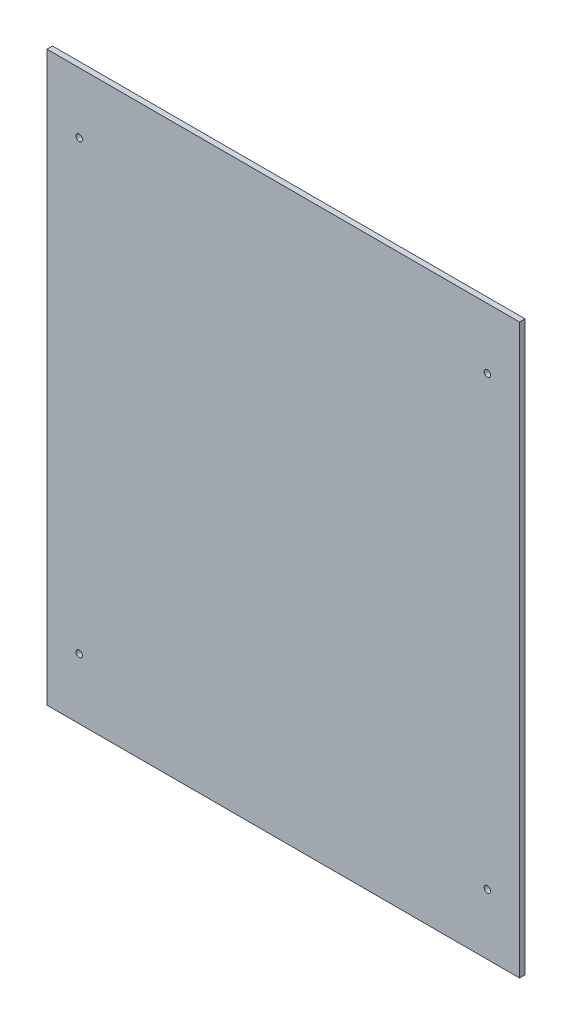
ISO-10303-21;
HEADER;
FILE_DESCRIPTION(('STEP AP214'),'2;1');
FILE_NAME('part.step','',(''),(''),'','','');
FILE_SCHEMA(('AUTOMOTIVE_DESIGN { 1 0 10303 214 1 1 1 1 }'));
ENDSEC;
DATA;
#1=APPLICATION_CONTEXT('core data for automotive mechanical design processes');
#2=APPLICATION_PROTOCOL_DEFINITION('international standard','automotive_design',2000,#1);
#3=PRODUCT_CONTEXT('',#1,'mechanical');
#4=PRODUCT('Part','Part','',(#3));
#5=PRODUCT_RELATED_PRODUCT_CATEGORY('part','',(#4));
#6=PRODUCT_DEFINITION_FORMATION('','',#4);
#7=PRODUCT_DEFINITION_CONTEXT('part definition',#1,'design');
#8=PRODUCT_DEFINITION('design','',#6,#7);
#9=PRODUCT_DEFINITION_SHAPE('','',#8);
#10=(LENGTH_UNIT() NAMED_UNIT(*) SI_UNIT(.MILLI.,.METRE.));
#11=(NAMED_UNIT(*) PLANE_ANGLE_UNIT() SI_UNIT($,.RADIAN.));
#12=(NAMED_UNIT(*) SI_UNIT($,.STERADIAN.) SOLID_ANGLE_UNIT());
#13=UNCERTAINTY_MEASURE_WITH_UNIT(LENGTH_MEASURE(1.E-05),#10,'distance_accuracy_value','');
#14=(GEOMETRIC_REPRESENTATION_CONTEXT(3) GLOBAL_UNCERTAINTY_ASSIGNED_CONTEXT((#13)) GLOBAL_UNIT_ASSIGNED_CONTEXT((#10,
#11,#12)) REPRESENTATION_CONTEXT('',''));
#15=CARTESIAN_POINT('',(0.,0.,0.));
#16=DIRECTION('',(0.,0.,1.));
#17=DIRECTION('',(1.,0.,0.));
#18=AXIS2_PLACEMENT_3D('',#15,#16,#17);
#19=CARTESIAN_POINT('',(0.,0.,3.));
#20=DIRECTION('',(0.,0.,-1.));
#21=DIRECTION('',(-1.,0.,0.));
#22=AXIS2_PLACEMENT_3D('',#19,#20,#21);
#23=PLANE('',#22);
#24=DIRECTION('',(0.,-1.,0.));
#25=VECTOR('',#24,1.);
#26=CARTESIAN_POINT('',(-128.5,154.5,3.));
#27=LINE('',#26,#25);
#28=CARTESIAN_POINT('',(-128.5,154.5,3.));
#29=VERTEX_POINT('',#28);
#30=CARTESIAN_POINT('',(-128.5,-154.5,3.));
#31=VERTEX_POINT('',#30);
#32=EDGE_CURVE('E91',#29,#31,#27,.T.);
#33=ORIENTED_EDGE('',*,*,#32,.T.);
#34=DIRECTION('',(1.,0.,0.));
#35=VECTOR('',#34,1.);
#36=CARTESIAN_POINT('',(128.5,-154.5,3.));
#37=LINE('',#36,#35);
#38=CARTESIAN_POINT('',(128.5,-154.5,3.));
#39=VERTEX_POINT('',#38);
#40=EDGE_CURVE('E86',#31,#39,#37,.T.);
#41=ORIENTED_EDGE('',*,*,#40,.T.);
#42=DIRECTION('',(0.,1.,0.));
#43=VECTOR('',#42,1.);
#44=CARTESIAN_POINT('',(128.5,154.5,3.));
#45=LINE('',#44,#43);
#46=CARTESIAN_POINT('',(128.5,154.5,3.));
#47=VERTEX_POINT('',#46);
#48=EDGE_CURVE('E89',#39,#47,#45,.T.);
#49=ORIENTED_EDGE('',*,*,#48,.T.);
#50=DIRECTION('',(-1.,0.,0.));
#51=VECTOR('',#50,1.);
#52=CARTESIAN_POINT('',(128.5,154.5,3.));
#53=LINE('',#52,#51);
#54=EDGE_CURVE('E56',#47,#29,#53,.T.);
#55=ORIENTED_EDGE('',*,*,#54,.T.);
#56=EDGE_LOOP('',(#33,#41,#49,#55));
#57=FACE_BOUND('',#56,.T.);
#58=CARTESIAN_POINT('',(-111.,121.5,3.));
#59=DIRECTION('',(0.,0.,1.));
#60=DIRECTION('',(1.,0.,0.));
#61=AXIS2_PLACEMENT_3D('',#58,#59,#60);
#62=CIRCLE('',#61,1.75);
#63=CARTESIAN_POINT('',(-109.25,121.5,3.));
#64=VERTEX_POINT('',#63);
#65=EDGE_CURVE('E106',#64,#64,#62,.T.);
#66=ORIENTED_EDGE('',*,*,#65,.F.);
#67=EDGE_LOOP('',(#66));
#68=FACE_BOUND('',#67,.T.);
#69=CARTESIAN_POINT('',(111.,121.5,3.));
#70=DIRECTION('',(0.,0.,1.));
#71=DIRECTION('',(-1.,0.,0.));
#72=AXIS2_PLACEMENT_3D('',#69,#70,#71);
#73=CIRCLE('',#72,1.75);
#74=CARTESIAN_POINT('',(109.25,121.5,3.));
#75=VERTEX_POINT('',#74);
#76=EDGE_CURVE('E121',#75,#75,#73,.T.);
#77=ORIENTED_EDGE('',*,*,#76,.F.);
#78=EDGE_LOOP('',(#77));
#79=FACE_BOUND('',#78,.T.);
#80=CARTESIAN_POINT('',(111.,-121.5,3.));
#81=DIRECTION('',(0.,0.,1.));
#82=DIRECTION('',(1.,0.,0.));
#83=AXIS2_PLACEMENT_3D('',#80,#81,#82);
#84=CIRCLE('',#83,1.75);
#85=CARTESIAN_POINT('',(112.75,-121.5,3.));
#86=VERTEX_POINT('',#85);
#87=EDGE_CURVE('E127',#86,#86,#84,.T.);
#88=ORIENTED_EDGE('',*,*,#87,.F.);
#89=EDGE_LOOP('',(#88));
#90=FACE_BOUND('',#89,.T.);
#91=CARTESIAN_POINT('',(-111.,-121.5,3.));
#92=DIRECTION('',(0.,0.,1.));
#93=DIRECTION('',(-1.,0.,0.));
#94=AXIS2_PLACEMENT_3D('',#91,#92,#93);
#95=CIRCLE('',#94,1.75);
#96=CARTESIAN_POINT('',(-112.75,-121.5,3.));
#97=VERTEX_POINT('',#96);
#98=EDGE_CURVE('E133',#97,#97,#95,.T.);
#99=ORIENTED_EDGE('',*,*,#98,.F.);
#100=EDGE_LOOP('',(#99));
#101=FACE_BOUND('',#100,.T.);
#102=ADVANCED_FACE('F39',(#57,#68,#79,#90,#101),#23,.F.);
#103=CARTESIAN_POINT('',(0.,0.,0.));
#104=DIRECTION('',(0.,0.,-1.));
#105=DIRECTION('',(-1.,0.,0.));
#106=AXIS2_PLACEMENT_3D('',#103,#104,#105);
#107=PLANE('',#106);
#108=CARTESIAN_POINT('',(111.,-121.5,0.));
#109=DIRECTION('',(0.,0.,1.));
#110=DIRECTION('',(1.,0.,0.));
#111=AXIS2_PLACEMENT_3D('',#108,#109,#110);
#112=CIRCLE('',#111,1.75);
#113=CARTESIAN_POINT('',(112.75,-121.5,0.));
#114=VERTEX_POINT('',#113);
#115=EDGE_CURVE('E130',#114,#114,#112,.T.);
#116=ORIENTED_EDGE('',*,*,#115,.T.);
#117=EDGE_LOOP('',(#116));
#118=FACE_BOUND('',#117,.T.);
#119=CARTESIAN_POINT('',(-111.,121.5,0.));
#120=DIRECTION('',(0.,0.,1.));
#121=DIRECTION('',(1.,0.,0.));
#122=AXIS2_PLACEMENT_3D('',#119,#120,#121);
#123=CIRCLE('',#122,1.75);
#124=CARTESIAN_POINT('',(-109.25,121.5,0.));
#125=VERTEX_POINT('',#124);
#126=EDGE_CURVE('E118',#125,#125,#123,.T.);
#127=ORIENTED_EDGE('',*,*,#126,.T.);
#128=EDGE_LOOP('',(#127));
#129=FACE_BOUND('',#128,.T.);
#130=DIRECTION('',(0.,-1.,0.));
#131=VECTOR('',#130,1.);
#132=CARTESIAN_POINT('',(-128.5,154.5,0.));
#133=LINE('',#132,#131);
#134=CARTESIAN_POINT('',(-128.5,154.5,0.));
#135=VERTEX_POINT('',#134);
#136=CARTESIAN_POINT('',(-128.5,-154.5,0.));
#137=VERTEX_POINT('',#136);
#138=EDGE_CURVE('E103',#135,#137,#133,.T.);
#139=ORIENTED_EDGE('',*,*,#138,.F.);
#140=DIRECTION('',(-1.,0.,0.));
#141=VECTOR('',#140,1.);
#142=CARTESIAN_POINT('',(128.5,154.5,0.));
#143=LINE('',#142,#141);
#144=CARTESIAN_POINT('',(128.5,154.5,0.));
#145=VERTEX_POINT('',#144);
#146=EDGE_CURVE('E79',#145,#135,#143,.T.);
#147=ORIENTED_EDGE('',*,*,#146,.F.);
#148=DIRECTION('',(0.,1.,0.));
#149=VECTOR('',#148,1.);
#150=CARTESIAN_POINT('',(128.5,154.5,0.));
#151=LINE('',#150,#149);
#152=CARTESIAN_POINT('',(128.5,-154.5,0.));
#153=VERTEX_POINT('',#152);
#154=EDGE_CURVE('E73',#153,#145,#151,.T.);
#155=ORIENTED_EDGE('',*,*,#154,.F.);
#156=DIRECTION('',(1.,0.,0.));
#157=VECTOR('',#156,1.);
#158=CARTESIAN_POINT('',(128.5,-154.5,0.));
#159=LINE('',#158,#157);
#160=EDGE_CURVE('E95',#137,#153,#159,.T.);
#161=ORIENTED_EDGE('',*,*,#160,.F.);
#162=EDGE_LOOP('',(#139,#147,#155,#161));
#163=FACE_BOUND('',#162,.T.);
#164=CARTESIAN_POINT('',(111.,121.5,0.));
#165=DIRECTION('',(0.,0.,1.));
#166=DIRECTION('',(-1.,0.,0.));
#167=AXIS2_PLACEMENT_3D('',#164,#165,#166);
#168=CIRCLE('',#167,1.75);
#169=CARTESIAN_POINT('',(109.25,121.5,0.));
#170=VERTEX_POINT('',#169);
#171=EDGE_CURVE('E124',#170,#170,#168,.T.);
#172=ORIENTED_EDGE('',*,*,#171,.T.);
#173=EDGE_LOOP('',(#172));
#174=FACE_BOUND('',#173,.T.);
#175=CARTESIAN_POINT('',(-111.,-121.5,0.));
#176=DIRECTION('',(0.,0.,1.));
#177=DIRECTION('',(-1.,0.,0.));
#178=AXIS2_PLACEMENT_3D('',#175,#176,#177);
#179=CIRCLE('',#178,1.75);
#180=CARTESIAN_POINT('',(-112.75,-121.5,0.));
#181=VERTEX_POINT('',#180);
#182=EDGE_CURVE('E136',#181,#181,#179,.T.);
#183=ORIENTED_EDGE('',*,*,#182,.T.);
#184=EDGE_LOOP('',(#183));
#185=FACE_BOUND('',#184,.T.);
#186=ADVANCED_FACE('F114',(#118,#129,#163,#174,#185),#107,.T.);
#187=CARTESIAN_POINT('',(-128.5,154.5,3.));
#188=DIRECTION('',(1.,0.,0.));
#189=DIRECTION('',(0.,0.,-1.));
#190=AXIS2_PLACEMENT_3D('',#187,#188,#189);
#191=PLANE('',#190);
#192=ORIENTED_EDGE('',*,*,#138,.T.);
#193=DIRECTION('',(0.,0.,-1.));
#194=VECTOR('',#193,1.);
#195=CARTESIAN_POINT('',(-128.5,-154.5,3.));
#196=LINE('',#195,#194);
#197=EDGE_CURVE('E11',#31,#137,#196,.T.);
#198=ORIENTED_EDGE('',*,*,#197,.F.);
#199=ORIENTED_EDGE('',*,*,#32,.F.);
#200=DIRECTION('',(0.,0.,-1.));
#201=VECTOR('',#200,1.);
#202=CARTESIAN_POINT('',(-128.5,154.5,3.));
#203=LINE('',#202,#201);
#204=EDGE_CURVE('E99',#29,#135,#203,.T.);
#205=ORIENTED_EDGE('',*,*,#204,.T.);
#206=EDGE_LOOP('',(#192,#198,#199,#205));
#207=FACE_BOUND('',#206,.T.);
#208=ADVANCED_FACE('F41',(#207),#191,.F.);
#209=CARTESIAN_POINT('',(128.5,-154.5,3.));
#210=DIRECTION('',(0.,1.,0.));
#211=DIRECTION('',(-1.,0.,0.));
#212=AXIS2_PLACEMENT_3D('',#209,#210,#211);
#213=PLANE('',#212);
#214=ORIENTED_EDGE('',*,*,#160,.T.);
#215=DIRECTION('',(0.,0.,-1.));
#216=VECTOR('',#215,1.);
#217=CARTESIAN_POINT('',(128.5,-154.5,3.));
#218=LINE('',#217,#216);
#219=EDGE_CURVE('E48',#39,#153,#218,.T.);
#220=ORIENTED_EDGE('',*,*,#219,.F.);
#221=ORIENTED_EDGE('',*,*,#40,.F.);
#222=ORIENTED_EDGE('',*,*,#197,.T.);
#223=EDGE_LOOP('',(#214,#220,#221,#222));
#224=FACE_BOUND('',#223,.T.);
#225=ADVANCED_FACE('F94',(#224),#213,.F.);
#226=CARTESIAN_POINT('',(128.5,154.5,3.));
#227=DIRECTION('',(-1.,0.,0.));
#228=DIRECTION('',(0.,-1.,0.));
#229=AXIS2_PLACEMENT_3D('',#226,#227,#228);
#230=PLANE('',#229);
#231=ORIENTED_EDGE('',*,*,#154,.T.);
#232=DIRECTION('',(0.,0.,-1.));
#233=VECTOR('',#232,1.);
#234=CARTESIAN_POINT('',(128.5,154.5,3.));
#235=LINE('',#234,#233);
#236=EDGE_CURVE('E96',#47,#145,#235,.T.);
#237=ORIENTED_EDGE('',*,*,#236,.F.);
#238=ORIENTED_EDGE('',*,*,#48,.F.);
#239=ORIENTED_EDGE('',*,*,#219,.T.);
#240=EDGE_LOOP('',(#231,#237,#238,#239));
#241=FACE_BOUND('',#240,.T.);
#242=ADVANCED_FACE('F97',(#241),#230,.F.);
#243=CARTESIAN_POINT('',(128.5,154.5,3.));
#244=DIRECTION('',(0.,-1.,0.));
#245=DIRECTION('',(1.,0.,0.));
#246=AXIS2_PLACEMENT_3D('',#243,#244,#245);
#247=PLANE('',#246);
#248=ORIENTED_EDGE('',*,*,#146,.T.);
#249=ORIENTED_EDGE('',*,*,#204,.F.);
#250=ORIENTED_EDGE('',*,*,#54,.F.);
#251=ORIENTED_EDGE('',*,*,#236,.T.);
#252=EDGE_LOOP('',(#248,#249,#250,#251));
#253=FACE_BOUND('',#252,.T.);
#254=ADVANCED_FACE('F111',(#253),#247,.F.);
#255=CARTESIAN_POINT('',(-111.,121.5,3.));
#256=DIRECTION('',(0.,0.,-1.));
#257=DIRECTION('',(-1.,0.,0.));
#258=AXIS2_PLACEMENT_3D('',#255,#256,#257);
#259=CYLINDRICAL_SURFACE('',#258,1.75);
#260=ORIENTED_EDGE('',*,*,#65,.T.);
#261=EDGE_LOOP('',(#260));
#262=FACE_BOUND('',#261,.T.);
#263=ORIENTED_EDGE('',*,*,#126,.F.);
#264=EDGE_LOOP('',(#263));
#265=FACE_BOUND('',#264,.T.);
#266=ADVANCED_FACE('F153',(#262,#265),#259,.F.);
#267=CARTESIAN_POINT('',(111.,121.5,3.));
#268=DIRECTION('',(0.,0.,-1.));
#269=DIRECTION('',(-1.,0.,0.));
#270=AXIS2_PLACEMENT_3D('',#267,#268,#269);
#271=CYLINDRICAL_SURFACE('',#270,1.75);
#272=ORIENTED_EDGE('',*,*,#76,.T.);
#273=EDGE_LOOP('',(#272));
#274=FACE_BOUND('',#273,.T.);
#275=ORIENTED_EDGE('',*,*,#171,.F.);
#276=EDGE_LOOP('',(#275));
#277=FACE_BOUND('',#276,.T.);
#278=ADVANCED_FACE('F207',(#274,#277),#271,.F.);
#279=CARTESIAN_POINT('',(111.,-121.5,3.));
#280=DIRECTION('',(0.,0.,-1.));
#281=DIRECTION('',(-1.,0.,0.));
#282=AXIS2_PLACEMENT_3D('',#279,#280,#281);
#283=CYLINDRICAL_SURFACE('',#282,1.75);
#284=ORIENTED_EDGE('',*,*,#87,.T.);
#285=EDGE_LOOP('',(#284));
#286=FACE_BOUND('',#285,.T.);
#287=ORIENTED_EDGE('',*,*,#115,.F.);
#288=EDGE_LOOP('',(#287));
#289=FACE_BOUND('',#288,.T.);
#290=ADVANCED_FACE('F216',(#286,#289),#283,.F.);
#291=CARTESIAN_POINT('',(-111.,-121.5,3.));
#292=DIRECTION('',(0.,0.,-1.));
#293=DIRECTION('',(-1.,0.,0.));
#294=AXIS2_PLACEMENT_3D('',#291,#292,#293);
#295=CYLINDRICAL_SURFACE('',#294,1.75);
#296=ORIENTED_EDGE('',*,*,#98,.T.);
#297=EDGE_LOOP('',(#296));
#298=FACE_BOUND('',#297,.T.);
#299=ORIENTED_EDGE('',*,*,#182,.F.);
#300=EDGE_LOOP('',(#299));
#301=FACE_BOUND('',#300,.T.);
#302=ADVANCED_FACE('F142',(#298,#301),#295,.F.);
#303=CLOSED_SHELL('',(#102,#186,#208,#225,#242,#254,#266,#278,#290,#302));
#304=MANIFOLD_SOLID_BREP('B2',#303);
#305=ADVANCED_BREP_SHAPE_REPRESENTATION('',(#18,#304),#14);
#306=SHAPE_DEFINITION_REPRESENTATION(#9,#305);
ENDSEC;
END-ISO-10303-21;
